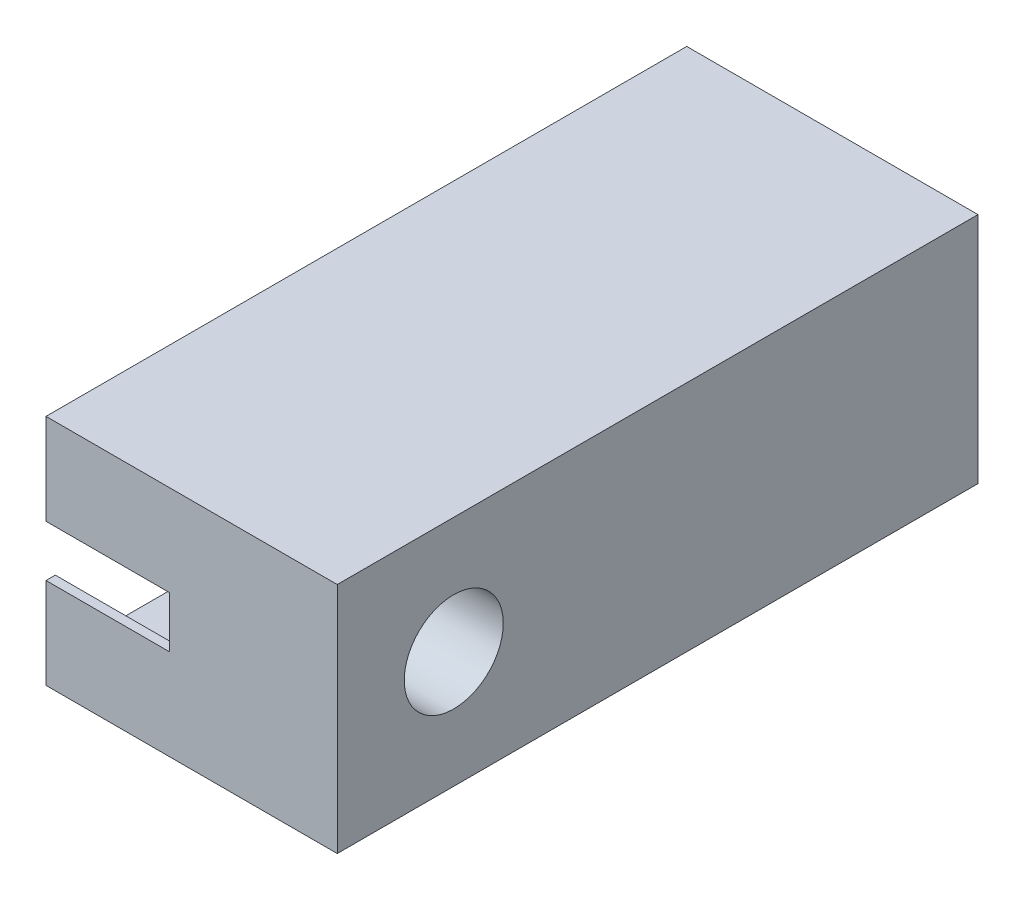
ISO-10303-21;
HEADER;
FILE_DESCRIPTION(('STEP AP214'),'2;1');
FILE_NAME('part.step','',(''),(''),'','','');
FILE_SCHEMA(('AUTOMOTIVE_DESIGN { 1 0 10303 214 1 1 1 1 }'));
ENDSEC;
DATA;
#1=APPLICATION_CONTEXT('core data for automotive mechanical design processes');
#2=APPLICATION_PROTOCOL_DEFINITION('international standard','automotive_design',2000,#1);
#3=PRODUCT_CONTEXT('',#1,'mechanical');
#4=PRODUCT('Part','Part','',(#3));
#5=PRODUCT_RELATED_PRODUCT_CATEGORY('part','',(#4));
#6=PRODUCT_DEFINITION_FORMATION('','',#4);
#7=PRODUCT_DEFINITION_CONTEXT('part definition',#1,'design');
#8=PRODUCT_DEFINITION('design','',#6,#7);
#9=PRODUCT_DEFINITION_SHAPE('','',#8);
#10=(LENGTH_UNIT() NAMED_UNIT(*) SI_UNIT(.MILLI.,.METRE.));
#11=(NAMED_UNIT(*) PLANE_ANGLE_UNIT() SI_UNIT($,.RADIAN.));
#12=(NAMED_UNIT(*) SI_UNIT($,.STERADIAN.) SOLID_ANGLE_UNIT());
#13=UNCERTAINTY_MEASURE_WITH_UNIT(LENGTH_MEASURE(1.E-05),#10,'distance_accuracy_value','');
#14=(GEOMETRIC_REPRESENTATION_CONTEXT(3) GLOBAL_UNCERTAINTY_ASSIGNED_CONTEXT((#13)) GLOBAL_UNIT_ASSIGNED_CONTEXT((#10,
#11,#12)) REPRESENTATION_CONTEXT('',''));
#15=CARTESIAN_POINT('',(0.,0.,0.));
#16=DIRECTION('',(0.,0.,1.));
#17=DIRECTION('',(1.,0.,0.));
#18=AXIS2_PLACEMENT_3D('',#15,#16,#17);
#19=CARTESIAN_POINT('',(31.75,6.35,-53.975));
#20=DIRECTION('',(-1.,0.,0.));
#21=DIRECTION('',(0.,0.,1.));
#22=AXIS2_PLACEMENT_3D('',#19,#20,#21);
#23=CYLINDRICAL_SURFACE('',#22,1.5875);
#24=CARTESIAN_POINT('',(22.86,6.35,-53.975));
#25=DIRECTION('',(-1.,0.,0.));
#26=DIRECTION('',(0.,0.,1.));
#27=AXIS2_PLACEMENT_3D('',#24,#25,#26);
#28=CIRCLE('',#27,1.5875);
#29=CARTESIAN_POINT('',(22.86,6.35,-52.3875));
#30=VERTEX_POINT('',#29);
#31=EDGE_CURVE('E362',#30,#30,#28,.T.);
#32=ORIENTED_EDGE('',*,*,#31,.T.);
#33=EDGE_LOOP('',(#32));
#34=FACE_BOUND('',#33,.T.);
#35=CARTESIAN_POINT('',(29.21,6.35,-53.975));
#36=DIRECTION('',(1.,0.,0.));
#37=DIRECTION('',(0.,0.,-1.));
#38=AXIS2_PLACEMENT_3D('',#35,#36,#37);
#39=CIRCLE('',#38,1.5875);
#40=CARTESIAN_POINT('',(29.21,6.35,-55.5625));
#41=VERTEX_POINT('',#40);
#42=EDGE_CURVE('E11',#41,#41,#39,.F.);
#43=ORIENTED_EDGE('',*,*,#42,.F.);
#44=EDGE_LOOP('',(#43));
#45=FACE_BOUND('',#44,.T.);
#46=ADVANCED_FACE('F44',(#34,#45),#23,.F.);
#47=CARTESIAN_POINT('',(31.75,-6.35,-53.975));
#48=DIRECTION('',(-1.,0.,0.));
#49=DIRECTION('',(0.,0.,1.));
#50=AXIS2_PLACEMENT_3D('',#47,#48,#49);
#51=CYLINDRICAL_SURFACE('',#50,1.5875);
#52=CARTESIAN_POINT('',(22.86,-6.35,-53.975));
#53=DIRECTION('',(-1.,0.,0.));
#54=DIRECTION('',(0.,0.,1.));
#55=AXIS2_PLACEMENT_3D('',#52,#53,#54);
#56=CIRCLE('',#55,1.5875);
#57=CARTESIAN_POINT('',(22.86,-6.35,-52.3875));
#58=VERTEX_POINT('',#57);
#59=EDGE_CURVE('E365',#58,#58,#56,.T.);
#60=ORIENTED_EDGE('',*,*,#59,.T.);
#61=EDGE_LOOP('',(#60));
#62=FACE_BOUND('',#61,.T.);
#63=CARTESIAN_POINT('',(29.21,-6.35,-53.975));
#64=DIRECTION('',(1.,0.,0.));
#65=DIRECTION('',(0.,0.,-1.));
#66=AXIS2_PLACEMENT_3D('',#63,#64,#65);
#67=CIRCLE('',#66,1.5875);
#68=CARTESIAN_POINT('',(29.21,-6.35,-55.5625));
#69=VERTEX_POINT('',#68);
#70=EDGE_CURVE('E53',#69,#69,#67,.F.);
#71=ORIENTED_EDGE('',*,*,#70,.F.);
#72=EDGE_LOOP('',(#71));
#73=FACE_BOUND('',#72,.T.);
#74=ADVANCED_FACE('F275',(#62,#73),#51,.F.);
#75=CARTESIAN_POINT('',(0.,0.,0.));
#76=DIRECTION('',(1.,0.,0.));
#77=DIRECTION('',(0.,0.,-1.));
#78=AXIS2_PLACEMENT_3D('',#75,#76,#77);
#79=PLANE('',#78);
#80=DIRECTION('',(0.,0.,1.));
#81=VECTOR('',#80,1.);
#82=CARTESIAN_POINT('',(0.,2.794,11.684));
#83=LINE('',#82,#81);
#84=CARTESIAN_POINT('',(0.,2.794,11.684));
#85=VERTEX_POINT('',#84);
#86=CARTESIAN_POINT('',(0.,2.794,12.7));
#87=VERTEX_POINT('',#86);
#88=EDGE_CURVE('E364',#85,#87,#83,.T.);
#89=ORIENTED_EDGE('',*,*,#88,.T.);
#90=DIRECTION('',(0.,-1.,0.));
#91=VECTOR('',#90,1.);
#92=CARTESIAN_POINT('',(0.,12.7,12.7));
#93=LINE('',#92,#91);
#94=CARTESIAN_POINT('',(0.,12.7,12.7));
#95=VERTEX_POINT('',#94);
#96=EDGE_CURVE('E235',#95,#87,#93,.T.);
#97=ORIENTED_EDGE('',*,*,#96,.F.);
#98=DIRECTION('',(0.,0.,1.));
#99=VECTOR('',#98,1.);
#100=CARTESIAN_POINT('',(0.,12.7,12.7));
#101=LINE('',#100,#99);
#102=CARTESIAN_POINT('',(0.,12.7,-57.15));
#103=VERTEX_POINT('',#102);
#104=EDGE_CURVE('E225',#103,#95,#101,.T.);
#105=ORIENTED_EDGE('',*,*,#104,.F.);
#106=DIRECTION('',(0.,1.,0.));
#107=VECTOR('',#106,1.);
#108=CARTESIAN_POINT('',(0.,12.7,-57.15));
#109=LINE('',#108,#107);
#110=CARTESIAN_POINT('',(0.,10.4775,-57.15));
#111=VERTEX_POINT('',#110);
#112=EDGE_CURVE('E242',#111,#103,#109,.T.);
#113=ORIENTED_EDGE('',*,*,#112,.F.);
#114=DIRECTION('',(0.,0.,1.));
#115=VECTOR('',#114,1.);
#116=CARTESIAN_POINT('',(0.,10.4775,-59.69));
#117=LINE('',#116,#115);
#118=CARTESIAN_POINT('',(0.,10.4775,11.684));
#119=VERTEX_POINT('',#118);
#120=EDGE_CURVE('E199',#111,#119,#117,.T.);
#121=ORIENTED_EDGE('',*,*,#120,.T.);
#122=DIRECTION('',(0.,-1.,0.));
#123=VECTOR('',#122,1.);
#124=CARTESIAN_POINT('',(0.,10.4775,11.684));
#125=LINE('',#124,#123);
#126=EDGE_CURVE('E189',#119,#85,#125,.T.);
#127=ORIENTED_EDGE('',*,*,#126,.T.);
#128=EDGE_LOOP('',(#89,#97,#105,#113,#121,#127));
#129=FACE_BOUND('',#128,.T.);
#130=ADVANCED_FACE('F277',(#129),#79,.F.);
#131=CARTESIAN_POINT('',(31.75,12.7,12.7));
#132=DIRECTION('',(0.,0.,-1.));
#133=DIRECTION('',(0.,1.,0.));
#134=AXIS2_PLACEMENT_3D('',#131,#132,#133);
#135=PLANE('',#134);
#136=DIRECTION('',(-1.,0.,0.));
#137=VECTOR('',#136,1.);
#138=CARTESIAN_POINT('',(31.75,2.794,12.7));
#139=LINE('',#138,#137);
#140=CARTESIAN_POINT('',(13.462,2.794,12.7));
#141=VERTEX_POINT('',#140);
#142=EDGE_CURVE('E181',#141,#87,#139,.T.);
#143=ORIENTED_EDGE('',*,*,#142,.F.);
#144=DIRECTION('',(0.,-1.,0.));
#145=VECTOR('',#144,1.);
#146=CARTESIAN_POINT('',(13.462,12.7,12.7));
#147=LINE('',#146,#145);
#148=CARTESIAN_POINT('',(13.462,-2.794,12.7));
#149=VERTEX_POINT('',#148);
#150=EDGE_CURVE('E171',#141,#149,#147,.T.);
#151=ORIENTED_EDGE('',*,*,#150,.T.);
#152=DIRECTION('',(-1.,0.,0.));
#153=VECTOR('',#152,1.);
#154=CARTESIAN_POINT('',(31.75,-2.794,12.7));
#155=LINE('',#154,#153);
#156=CARTESIAN_POINT('',(0.,-2.794,12.7));
#157=VERTEX_POINT('',#156);
#158=EDGE_CURVE('E154',#149,#157,#155,.T.);
#159=ORIENTED_EDGE('',*,*,#158,.T.);
#160=CARTESIAN_POINT('',(0.,-12.7,12.7));
#161=VERTEX_POINT('',#160);
#162=EDGE_CURVE('E220',#157,#161,#93,.T.);
#163=ORIENTED_EDGE('',*,*,#162,.T.);
#164=DIRECTION('',(-1.,0.,0.));
#165=VECTOR('',#164,1.);
#166=CARTESIAN_POINT('',(31.75,-12.7,12.7));
#167=LINE('',#166,#165);
#168=CARTESIAN_POINT('',(31.75,-12.7,12.7));
#169=VERTEX_POINT('',#168);
#170=EDGE_CURVE('E257',#169,#161,#167,.T.);
#171=ORIENTED_EDGE('',*,*,#170,.F.);
#172=DIRECTION('',(0.,-1.,0.));
#173=VECTOR('',#172,1.);
#174=CARTESIAN_POINT('',(31.75,12.7,12.7));
#175=LINE('',#174,#173);
#176=CARTESIAN_POINT('',(31.75,12.7,12.7));
#177=VERTEX_POINT('',#176);
#178=EDGE_CURVE('E221',#177,#169,#175,.T.);
#179=ORIENTED_EDGE('',*,*,#178,.F.);
#180=DIRECTION('',(-1.,0.,0.));
#181=VECTOR('',#180,1.);
#182=CARTESIAN_POINT('',(31.75,12.7,12.7));
#183=LINE('',#182,#181);
#184=EDGE_CURVE('E234',#177,#95,#183,.T.);
#185=ORIENTED_EDGE('',*,*,#184,.T.);
#186=ORIENTED_EDGE('',*,*,#96,.T.);
#187=EDGE_LOOP('',(#143,#151,#159,#163,#171,#179,#185,#186));
#188=FACE_BOUND('',#187,.T.);
#189=ADVANCED_FACE('F46',(#188),#135,.F.);
#190=CARTESIAN_POINT('',(22.86,10.4775,11.684));
#191=DIRECTION('',(0.,0.,-1.));
#192=DIRECTION('',(-1.,0.,0.));
#193=AXIS2_PLACEMENT_3D('',#190,#191,#192);
#194=PLANE('',#193);
#195=DIRECTION('',(0.,-1.,0.));
#196=VECTOR('',#195,1.);
#197=CARTESIAN_POINT('',(13.462,2.794,11.684));
#198=LINE('',#197,#196);
#199=CARTESIAN_POINT('',(13.462,2.794,11.684));
#200=VERTEX_POINT('',#199);
#201=CARTESIAN_POINT('',(13.462,-2.794,11.684));
#202=VERTEX_POINT('',#201);
#203=EDGE_CURVE('E157',#200,#202,#198,.T.);
#204=ORIENTED_EDGE('',*,*,#203,.F.);
#205=DIRECTION('',(-1.,0.,0.));
#206=VECTOR('',#205,1.);
#207=CARTESIAN_POINT('',(13.462,2.794,11.684));
#208=LINE('',#207,#206);
#209=EDGE_CURVE('E164',#200,#85,#208,.T.);
#210=ORIENTED_EDGE('',*,*,#209,.T.);
#211=ORIENTED_EDGE('',*,*,#126,.F.);
#212=DIRECTION('',(-1.,0.,0.));
#213=VECTOR('',#212,1.);
#214=CARTESIAN_POINT('',(22.86,10.4775,11.684));
#215=LINE('',#214,#213);
#216=CARTESIAN_POINT('',(22.86,10.4775,11.684));
#217=VERTEX_POINT('',#216);
#218=EDGE_CURVE('E208',#217,#119,#215,.T.);
#219=ORIENTED_EDGE('',*,*,#218,.F.);
#220=DIRECTION('',(0.,-1.,0.));
#221=VECTOR('',#220,1.);
#222=CARTESIAN_POINT('',(22.86,10.4775,11.684));
#223=LINE('',#222,#221);
#224=CARTESIAN_POINT('',(22.86,-10.4775,11.684));
#225=VERTEX_POINT('',#224);
#226=EDGE_CURVE('E192',#217,#225,#223,.T.);
#227=ORIENTED_EDGE('',*,*,#226,.T.);
#228=DIRECTION('',(-1.,0.,0.));
#229=VECTOR('',#228,1.);
#230=CARTESIAN_POINT('',(22.86,-10.4775,11.684));
#231=LINE('',#230,#229);
#232=CARTESIAN_POINT('',(0.,-10.4775,11.684));
#233=VERTEX_POINT('',#232);
#234=EDGE_CURVE('E195',#225,#233,#231,.T.);
#235=ORIENTED_EDGE('',*,*,#234,.T.);
#236=CARTESIAN_POINT('',(0.,-2.794,11.684));
#237=VERTEX_POINT('',#236);
#238=EDGE_CURVE('E169',#237,#233,#125,.T.);
#239=ORIENTED_EDGE('',*,*,#238,.F.);
#240=DIRECTION('',(-1.,0.,0.));
#241=VECTOR('',#240,1.);
#242=CARTESIAN_POINT('',(13.462,-2.794,11.684));
#243=LINE('',#242,#241);
#244=EDGE_CURVE('E151',#202,#237,#243,.T.);
#245=ORIENTED_EDGE('',*,*,#244,.F.);
#246=EDGE_LOOP('',(#204,#210,#211,#219,#227,#235,#239,#245));
#247=FACE_BOUND('',#246,.T.);
#248=ADVANCED_FACE('F167',(#247),#194,.T.);
#249=ORIENTED_EDGE('',*,*,#162,.F.);
#250=DIRECTION('',(0.,0.,1.));
#251=VECTOR('',#250,1.);
#252=CARTESIAN_POINT('',(0.,-2.794,11.684));
#253=LINE('',#252,#251);
#254=EDGE_CURVE('E369',#237,#157,#253,.T.);
#255=ORIENTED_EDGE('',*,*,#254,.F.);
#256=ORIENTED_EDGE('',*,*,#238,.T.);
#257=DIRECTION('',(0.,0.,-1.));
#258=VECTOR('',#257,1.);
#259=CARTESIAN_POINT('',(0.,-10.4775,11.684));
#260=LINE('',#259,#258);
#261=CARTESIAN_POINT('',(0.,-10.4775,-57.15));
#262=VERTEX_POINT('',#261);
#263=EDGE_CURVE('E184',#233,#262,#260,.T.);
#264=ORIENTED_EDGE('',*,*,#263,.T.);
#265=CARTESIAN_POINT('',(0.,-12.7,-57.15));
#266=VERTEX_POINT('',#265);
#267=EDGE_CURVE('E243',#266,#262,#109,.T.);
#268=ORIENTED_EDGE('',*,*,#267,.F.);
#269=DIRECTION('',(0.,0.,-1.));
#270=VECTOR('',#269,1.);
#271=CARTESIAN_POINT('',(0.,-12.7,12.7));
#272=LINE('',#271,#270);
#273=EDGE_CURVE('E239',#161,#266,#272,.T.);
#274=ORIENTED_EDGE('',*,*,#273,.F.);
#275=EDGE_LOOP('',(#249,#255,#256,#264,#268,#274));
#276=FACE_BOUND('',#275,.T.);
#277=ADVANCED_FACE('F286',(#276),#79,.F.);
#278=CARTESIAN_POINT('',(31.75,12.7,-57.15));
#279=DIRECTION('',(0.,0.,1.));
#280=DIRECTION('',(0.,-1.,0.));
#281=AXIS2_PLACEMENT_3D('',#278,#279,#280);
#282=PLANE('',#281);
#283=DIRECTION('',(-1.,0.,0.));
#284=VECTOR('',#283,1.);
#285=CARTESIAN_POINT('',(31.75,-10.4775,-57.15));
#286=LINE('',#285,#284);
#287=CARTESIAN_POINT('',(22.86,-10.4775,-57.15));
#288=VERTEX_POINT('',#287);
#289=EDGE_CURVE('E266',#288,#262,#286,.T.);
#290=ORIENTED_EDGE('',*,*,#289,.F.);
#291=DIRECTION('',(0.,1.,0.));
#292=VECTOR('',#291,1.);
#293=CARTESIAN_POINT('',(22.86,12.7,-57.15));
#294=LINE('',#293,#292);
#295=CARTESIAN_POINT('',(22.86,10.4775,-57.15));
#296=VERTEX_POINT('',#295);
#297=EDGE_CURVE('E212',#288,#296,#294,.T.);
#298=ORIENTED_EDGE('',*,*,#297,.T.);
#299=DIRECTION('',(1.,0.,0.));
#300=VECTOR('',#299,1.);
#301=CARTESIAN_POINT('',(31.75,10.4775,-57.15));
#302=LINE('',#301,#300);
#303=EDGE_CURVE('E261',#111,#296,#302,.T.);
#304=ORIENTED_EDGE('',*,*,#303,.F.);
#305=ORIENTED_EDGE('',*,*,#112,.T.);
#306=DIRECTION('',(-1.,0.,0.));
#307=VECTOR('',#306,1.);
#308=CARTESIAN_POINT('',(31.75,12.7,-57.15));
#309=LINE('',#308,#307);
#310=CARTESIAN_POINT('',(31.75,12.7,-57.15));
#311=VERTEX_POINT('',#310);
#312=EDGE_CURVE('E251',#311,#103,#309,.T.);
#313=ORIENTED_EDGE('',*,*,#312,.F.);
#314=DIRECTION('',(0.,1.,0.));
#315=VECTOR('',#314,1.);
#316=CARTESIAN_POINT('',(31.75,12.7,-57.15));
#317=LINE('',#316,#315);
#318=CARTESIAN_POINT('',(31.75,-12.7,-57.15));
#319=VERTEX_POINT('',#318);
#320=EDGE_CURVE('E228',#319,#311,#317,.T.);
#321=ORIENTED_EDGE('',*,*,#320,.F.);
#322=DIRECTION('',(-1.,0.,0.));
#323=VECTOR('',#322,1.);
#324=CARTESIAN_POINT('',(31.75,-12.7,-57.15));
#325=LINE('',#324,#323);
#326=EDGE_CURVE('E254',#319,#266,#325,.T.);
#327=ORIENTED_EDGE('',*,*,#326,.T.);
#328=ORIENTED_EDGE('',*,*,#267,.T.);
#329=EDGE_LOOP('',(#290,#298,#304,#305,#313,#321,#327,#328));
#330=FACE_BOUND('',#329,.T.);
#331=ADVANCED_FACE('F322',(#330),#282,.F.);
#332=CARTESIAN_POINT('',(31.75,0.,0.));
#333=DIRECTION('',(1.,0.,0.));
#334=DIRECTION('',(0.,0.,-1.));
#335=AXIS2_PLACEMENT_3D('',#332,#333,#334);
#336=PLANE('',#335);
#337=ORIENTED_EDGE('',*,*,#178,.T.);
#338=DIRECTION('',(0.,0.,-1.));
#339=VECTOR('',#338,1.);
#340=CARTESIAN_POINT('',(31.75,-12.7,12.7));
#341=LINE('',#340,#339);
#342=EDGE_CURVE('E224',#169,#319,#341,.T.);
#343=ORIENTED_EDGE('',*,*,#342,.T.);
#344=ORIENTED_EDGE('',*,*,#320,.T.);
#345=DIRECTION('',(0.,0.,1.));
#346=VECTOR('',#345,1.);
#347=CARTESIAN_POINT('',(31.75,12.7,12.7));
#348=LINE('',#347,#346);
#349=EDGE_CURVE('E231',#311,#177,#348,.T.);
#350=ORIENTED_EDGE('',*,*,#349,.T.);
#351=EDGE_LOOP('',(#337,#343,#344,#350));
#352=FACE_BOUND('',#351,.T.);
#353=CARTESIAN_POINT('',(31.75,0.,0.));
#354=DIRECTION('',(1.,0.,0.));
#355=DIRECTION('',(0.,0.,-1.));
#356=AXIS2_PLACEMENT_3D('',#353,#354,#355);
#357=CIRCLE('',#356,5.3975);
#358=CARTESIAN_POINT('',(31.75,0.,-5.3975));
#359=VERTEX_POINT('',#358);
#360=EDGE_CURVE('E216',#359,#359,#357,.T.);
#361=ORIENTED_EDGE('',*,*,#360,.F.);
#362=EDGE_LOOP('',(#361));
#363=FACE_BOUND('',#362,.T.);
#364=ADVANCED_FACE('F319',(#352,#363),#336,.T.);
#365=CARTESIAN_POINT('',(31.75,-12.7,12.7));
#366=DIRECTION('',(0.,1.,0.));
#367=DIRECTION('',(0.,0.,1.));
#368=AXIS2_PLACEMENT_3D('',#365,#366,#367);
#369=PLANE('',#368);
#370=ORIENTED_EDGE('',*,*,#273,.T.);
#371=ORIENTED_EDGE('',*,*,#326,.F.);
#372=ORIENTED_EDGE('',*,*,#342,.F.);
#373=ORIENTED_EDGE('',*,*,#170,.T.);
#374=EDGE_LOOP('',(#370,#371,#372,#373));
#375=FACE_BOUND('',#374,.T.);
#376=ADVANCED_FACE('F321',(#375),#369,.F.);
#377=CARTESIAN_POINT('',(31.75,12.7,12.7));
#378=DIRECTION('',(0.,-1.,0.));
#379=DIRECTION('',(0.,0.,-1.));
#380=AXIS2_PLACEMENT_3D('',#377,#378,#379);
#381=PLANE('',#380);
#382=ORIENTED_EDGE('',*,*,#104,.T.);
#383=ORIENTED_EDGE('',*,*,#184,.F.);
#384=ORIENTED_EDGE('',*,*,#349,.F.);
#385=ORIENTED_EDGE('',*,*,#312,.T.);
#386=EDGE_LOOP('',(#382,#383,#384,#385));
#387=FACE_BOUND('',#386,.T.);
#388=ADVANCED_FACE('F317',(#387),#381,.F.);
#389=CARTESIAN_POINT('',(31.75,0.,0.));
#390=DIRECTION('',(-1.,0.,0.));
#391=DIRECTION('',(0.,0.,1.));
#392=AXIS2_PLACEMENT_3D('',#389,#390,#391);
#393=CYLINDRICAL_SURFACE('',#392,5.3975);
#394=CARTESIAN_POINT('',(22.86,0.,0.));
#395=DIRECTION('',(1.,0.,0.));
#396=DIRECTION('',(0.,0.,-1.));
#397=AXIS2_PLACEMENT_3D('',#394,#395,#396);
#398=CIRCLE('',#397,5.3975);
#399=CARTESIAN_POINT('',(22.86,0.,-5.3975));
#400=VERTEX_POINT('',#399);
#401=EDGE_CURVE('E211',#400,#400,#398,.T.);
#402=ORIENTED_EDGE('',*,*,#401,.F.);
#403=EDGE_LOOP('',(#402));
#404=FACE_BOUND('',#403,.T.);
#405=ORIENTED_EDGE('',*,*,#360,.T.);
#406=EDGE_LOOP('',(#405));
#407=FACE_BOUND('',#406,.T.);
#408=ADVANCED_FACE('F313',(#404,#407),#393,.F.);
#409=CARTESIAN_POINT('',(22.86,-10.4775,11.684));
#410=DIRECTION('',(0.,1.,0.));
#411=DIRECTION('',(0.,0.,1.));
#412=AXIS2_PLACEMENT_3D('',#409,#410,#411);
#413=PLANE('',#412);
#414=ORIENTED_EDGE('',*,*,#289,.T.);
#415=ORIENTED_EDGE('',*,*,#263,.F.);
#416=ORIENTED_EDGE('',*,*,#234,.F.);
#417=DIRECTION('',(0.,0.,-1.));
#418=VECTOR('',#417,1.);
#419=CARTESIAN_POINT('',(22.86,-10.4775,11.684));
#420=LINE('',#419,#418);
#421=EDGE_CURVE('E185',#225,#288,#420,.T.);
#422=ORIENTED_EDGE('',*,*,#421,.T.);
#423=EDGE_LOOP('',(#414,#415,#416,#422));
#424=FACE_BOUND('',#423,.T.);
#425=ADVANCED_FACE('F309',(#424),#413,.T.);
#426=CARTESIAN_POINT('',(22.86,10.4775,-59.69));
#427=DIRECTION('',(0.,-1.,0.));
#428=DIRECTION('',(0.,0.,-1.));
#429=AXIS2_PLACEMENT_3D('',#426,#427,#428);
#430=PLANE('',#429);
#431=ORIENTED_EDGE('',*,*,#303,.T.);
#432=DIRECTION('',(0.,0.,1.));
#433=VECTOR('',#432,1.);
#434=CARTESIAN_POINT('',(22.86,10.4775,-59.69));
#435=LINE('',#434,#433);
#436=EDGE_CURVE('E71',#296,#217,#435,.T.);
#437=ORIENTED_EDGE('',*,*,#436,.T.);
#438=ORIENTED_EDGE('',*,*,#218,.T.);
#439=ORIENTED_EDGE('',*,*,#120,.F.);
#440=EDGE_LOOP('',(#431,#437,#438,#439));
#441=FACE_BOUND('',#440,.T.);
#442=ADVANCED_FACE('F303',(#441),#430,.T.);
#443=CARTESIAN_POINT('',(22.86,0.,0.));
#444=DIRECTION('',(1.,0.,0.));
#445=DIRECTION('',(0.,0.,-1.));
#446=AXIS2_PLACEMENT_3D('',#443,#444,#445);
#447=PLANE('',#446);
#448=ORIENTED_EDGE('',*,*,#31,.F.);
#449=EDGE_LOOP('',(#448));
#450=FACE_BOUND('',#449,.T.);
#451=ORIENTED_EDGE('',*,*,#59,.F.);
#452=EDGE_LOOP('',(#451));
#453=FACE_BOUND('',#452,.T.);
#454=ORIENTED_EDGE('',*,*,#401,.T.);
#455=EDGE_LOOP('',(#454));
#456=FACE_BOUND('',#455,.T.);
#457=ORIENTED_EDGE('',*,*,#421,.F.);
#458=ORIENTED_EDGE('',*,*,#226,.F.);
#459=ORIENTED_EDGE('',*,*,#436,.F.);
#460=ORIENTED_EDGE('',*,*,#297,.F.);
#461=EDGE_LOOP('',(#457,#458,#459,#460));
#462=FACE_BOUND('',#461,.T.);
#463=ADVANCED_FACE('F299',(#450,#453,#456,#462),#447,.F.);
#464=CARTESIAN_POINT('',(13.462,2.794,11.684));
#465=DIRECTION('',(0.,-1.,0.));
#466=DIRECTION('',(0.,0.,-1.));
#467=AXIS2_PLACEMENT_3D('',#464,#465,#466);
#468=PLANE('',#467);
#469=ORIENTED_EDGE('',*,*,#142,.T.);
#470=ORIENTED_EDGE('',*,*,#88,.F.);
#471=ORIENTED_EDGE('',*,*,#209,.F.);
#472=DIRECTION('',(0.,0.,1.));
#473=VECTOR('',#472,1.);
#474=CARTESIAN_POINT('',(13.462,2.794,11.684));
#475=LINE('',#474,#473);
#476=EDGE_CURVE('E63',#200,#141,#475,.T.);
#477=ORIENTED_EDGE('',*,*,#476,.T.);
#478=EDGE_LOOP('',(#469,#470,#471,#477));
#479=FACE_BOUND('',#478,.T.);
#480=ADVANCED_FACE('F296',(#479),#468,.T.);
#481=CARTESIAN_POINT('',(13.462,-2.794,11.684));
#482=DIRECTION('',(0.,-1.,0.));
#483=DIRECTION('',(0.,0.,-1.));
#484=AXIS2_PLACEMENT_3D('',#481,#482,#483);
#485=PLANE('',#484);
#486=DIRECTION('',(0.,0.,1.));
#487=VECTOR('',#486,1.);
#488=CARTESIAN_POINT('',(13.462,-2.794,11.684));
#489=LINE('',#488,#487);
#490=EDGE_CURVE('E148',#202,#149,#489,.T.);
#491=ORIENTED_EDGE('',*,*,#490,.F.);
#492=ORIENTED_EDGE('',*,*,#244,.T.);
#493=ORIENTED_EDGE('',*,*,#254,.T.);
#494=ORIENTED_EDGE('',*,*,#158,.F.);
#495=EDGE_LOOP('',(#491,#492,#493,#494));
#496=FACE_BOUND('',#495,.T.);
#497=ADVANCED_FACE('F149',(#496),#485,.F.);
#498=CARTESIAN_POINT('',(13.462,0.,0.));
#499=DIRECTION('',(1.,0.,0.));
#500=DIRECTION('',(0.,0.,-1.));
#501=AXIS2_PLACEMENT_3D('',#498,#499,#500);
#502=PLANE('',#501);
#503=ORIENTED_EDGE('',*,*,#476,.F.);
#504=ORIENTED_EDGE('',*,*,#203,.T.);
#505=ORIENTED_EDGE('',*,*,#490,.T.);
#506=ORIENTED_EDGE('',*,*,#150,.F.);
#507=EDGE_LOOP('',(#503,#504,#505,#506));
#508=FACE_BOUND('',#507,.T.);
#509=ADVANCED_FACE('F160',(#508),#502,.F.);
#510=CARTESIAN_POINT('',(29.21,-6.35,-53.975));
#511=DIRECTION('',(1.,0.,0.));
#512=DIRECTION('',(0.,0.,-1.));
#513=AXIS2_PLACEMENT_3D('',#510,#511,#512);
#514=PLANE('',#513);
#515=ORIENTED_EDGE('',*,*,#70,.T.);
#516=EDGE_LOOP('',(#515));
#517=FACE_BOUND('',#516,.T.);
#518=ADVANCED_FACE('F273',(#517),#514,.F.);
#519=CARTESIAN_POINT('',(29.21,6.35,-53.975));
#520=DIRECTION('',(1.,0.,0.));
#521=DIRECTION('',(0.,0.,-1.));
#522=AXIS2_PLACEMENT_3D('',#519,#520,#521);
#523=PLANE('',#522);
#524=ORIENTED_EDGE('',*,*,#42,.T.);
#525=EDGE_LOOP('',(#524));
#526=FACE_BOUND('',#525,.T.);
#527=ADVANCED_FACE('F385',(#526),#523,.F.);
#528=CLOSED_SHELL('',(#46,#74,#130,#189,#248,#277,#331,#364,#376,#388,#408,#425,#442,#463,#480,
#497,#509,#518,#527));
#529=MANIFOLD_SOLID_BREP('B2',#528);
#530=ADVANCED_BREP_SHAPE_REPRESENTATION('',(#18,#529),#14);
#531=SHAPE_DEFINITION_REPRESENTATION(#9,#530);
ENDSEC;
END-ISO-10303-21;
